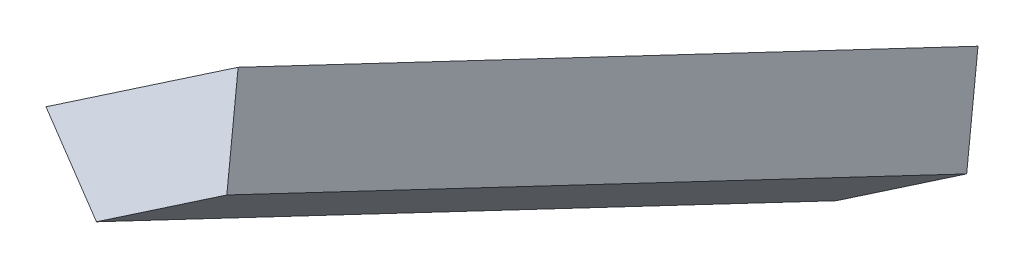
ISO-10303-21;
HEADER;
FILE_DESCRIPTION(('STEP AP214'),'2;1');
FILE_NAME('part.step','',(''),(''),'','','');
FILE_SCHEMA(('AUTOMOTIVE_DESIGN { 1 0 10303 214 1 1 1 1 }'));
ENDSEC;
DATA;
#1=APPLICATION_CONTEXT('core data for automotive mechanical design processes');
#2=APPLICATION_PROTOCOL_DEFINITION('international standard','automotive_design',2000,#1);
#3=PRODUCT_CONTEXT('',#1,'mechanical');
#4=PRODUCT('Part','Part','',(#3));
#5=PRODUCT_RELATED_PRODUCT_CATEGORY('part','',(#4));
#6=PRODUCT_DEFINITION_FORMATION('','',#4);
#7=PRODUCT_DEFINITION_CONTEXT('part definition',#1,'design');
#8=PRODUCT_DEFINITION('design','',#6,#7);
#9=PRODUCT_DEFINITION_SHAPE('','',#8);
#10=(LENGTH_UNIT() NAMED_UNIT(*) SI_UNIT(.MILLI.,.METRE.));
#11=(NAMED_UNIT(*) PLANE_ANGLE_UNIT() SI_UNIT($,.RADIAN.));
#12=(NAMED_UNIT(*) SI_UNIT($,.STERADIAN.) SOLID_ANGLE_UNIT());
#13=UNCERTAINTY_MEASURE_WITH_UNIT(LENGTH_MEASURE(1.E-05),#10,'distance_accuracy_value','');
#14=(GEOMETRIC_REPRESENTATION_CONTEXT(3) GLOBAL_UNCERTAINTY_ASSIGNED_CONTEXT((#13)) GLOBAL_UNIT_ASSIGNED_CONTEXT((#10,
#11,#12)) REPRESENTATION_CONTEXT('',''));
#15=CARTESIAN_POINT('',(0.,0.,0.));
#16=DIRECTION('',(0.,0.,1.));
#17=DIRECTION('',(1.,0.,0.));
#18=AXIS2_PLACEMENT_3D('',#15,#16,#17);
#19=CARTESIAN_POINT('',(-9.81853515268757,94.3301348946342,8.64655783941392));
#20=DIRECTION('',(-0.934792610632294,-0.18408948844942,0.303766086569405));
#21=DIRECTION('',(0.309047873167845,0.,0.951046482612933));
#22=AXIS2_PLACEMENT_3D('',#19,#20,#21);
#23=PLANE('',#22);
#24=DIRECTION('',(-0.307334088049531,0.847944500694674,-0.431897999606877));
#25=VECTOR('',#24,1.);
#26=CARTESIAN_POINT('',(-10.8869485574522,91.3475785039808,3.55118246824727));
#27=LINE('',#26,#25);
#28=CARTESIAN_POINT('',(-10.7349918670689,90.9283251736,3.76472790025564));
#29=VERTEX_POINT('',#28);
#30=CARTESIAN_POINT('',(-10.8869485574522,91.3475785039808,3.55118246824727));
#31=VERTEX_POINT('',#30);
#32=EDGE_CURVE('E97',#29,#31,#27,.T.);
#33=ORIENTED_EDGE('',*,*,#32,.T.);
#34=DIRECTION('',(-0.178068900794109,-0.497092731775569,-0.849229228527775));
#35=VECTOR('',#34,1.);
#36=CARTESIAN_POINT('',(-9.81853515268757,94.3301348946342,8.64655783941392));
#37=LINE('',#36,#35);
#38=CARTESIAN_POINT('',(-9.81853515268757,94.3301348946342,8.64655783941392));
#39=VERTEX_POINT('',#38);
#40=EDGE_CURVE('E11',#39,#31,#37,.T.);
#41=ORIENTED_EDGE('',*,*,#40,.F.);
#42=DIRECTION('',(-0.307334088049531,0.847944500694674,-0.431897999606877));
#43=VECTOR('',#42,1.);
#44=CARTESIAN_POINT('',(-9.81853515268757,94.3301348946342,8.64655783941392));
#45=LINE('',#44,#43);
#46=CARTESIAN_POINT('',(-9.66657846230426,93.9108815642534,8.86010327142229));
#47=VERTEX_POINT('',#46);
#48=EDGE_CURVE('E85',#47,#39,#45,.T.);
#49=ORIENTED_EDGE('',*,*,#48,.F.);
#50=DIRECTION('',(-0.178068900794109,-0.497092731775569,-0.849229228527775));
#51=VECTOR('',#50,1.);
#52=CARTESIAN_POINT('',(-9.66657846230426,93.9108815642534,8.86010327142229));
#53=LINE('',#52,#51);
#54=EDGE_CURVE('E93',#47,#29,#53,.T.);
#55=ORIENTED_EDGE('',*,*,#54,.T.);
#56=EDGE_LOOP('',(#33,#41,#49,#55));
#57=FACE_BOUND('',#56,.T.);
#58=ADVANCED_FACE('F34',(#57),#23,.F.);
#59=CARTESIAN_POINT('',(-10.5108331257332,93.9743739046871,8.99996411813385));
#60=DIRECTION('',(0.558938039832381,-0.761377752861772,0.32846945836028));
#61=DIRECTION('',(0.806104806775731,0.591772794654386,0.));
#62=AXIS2_PLACEMENT_3D('',#59,#60,#61);
#63=PLANE('',#62);
#64=DIRECTION('',(-0.809864022042166,-0.416176324967027,0.413421736654746));
#65=VECTOR('',#64,1.);
#66=CARTESIAN_POINT('',(-11.5792465304978,90.9918175140337,3.9045887469672));
#67=LINE('',#66,#65);
#68=CARTESIAN_POINT('',(-11.5792465304978,90.9918175140337,3.9045887469672));
#69=VERTEX_POINT('',#68);
#70=EDGE_CURVE('E89',#31,#69,#67,.T.);
#71=ORIENTED_EDGE('',*,*,#70,.T.);
#72=DIRECTION('',(-0.178068900794109,-0.497092731775569,-0.849229228527775));
#73=VECTOR('',#72,1.);
#74=CARTESIAN_POINT('',(-10.5108331257332,93.9743739046871,8.99996411813385));
#75=LINE('',#74,#73);
#76=CARTESIAN_POINT('',(-10.5108331257332,93.9743739046871,8.99996411813385));
#77=VERTEX_POINT('',#76);
#78=EDGE_CURVE('E42',#77,#69,#75,.T.);
#79=ORIENTED_EDGE('',*,*,#78,.F.);
#80=DIRECTION('',(-0.809864022042166,-0.416176324967027,0.413421736654746));
#81=VECTOR('',#80,1.);
#82=CARTESIAN_POINT('',(-10.5108331257332,93.9743739046871,8.99996411813385));
#83=LINE('',#82,#81);
#84=EDGE_CURVE('E80',#39,#77,#83,.T.);
#85=ORIENTED_EDGE('',*,*,#84,.F.);
#86=ORIENTED_EDGE('',*,*,#40,.T.);
#87=EDGE_LOOP('',(#71,#79,#85,#86));
#88=FACE_BOUND('',#87,.T.);
#89=ADVANCED_FACE('F88',(#88),#63,.F.);
#90=CARTESIAN_POINT('',(-10.1362995950887,93.6694992957726,9.09988787868204));
#91=DIRECTION('',(0.625717050942688,0.608870053848366,-0.487601712144526));
#92=DIRECTION('',(-0.697392776795336,0.716689134055826,0.));
#93=AXIS2_PLACEMENT_3D('',#90,#91,#92);
#94=PLANE('',#93);
#95=DIRECTION('',(0.759453513211678,-0.618203909355642,0.202618576956413));
#96=VECTOR('',#95,1.);
#97=CARTESIAN_POINT('',(-11.2047129998534,90.6869429051192,4.00451250751539));
#98=LINE('',#97,#96);
#99=CARTESIAN_POINT('',(-11.2047129998534,90.6869429051192,4.00451250751539));
#100=VERTEX_POINT('',#99);
#101=EDGE_CURVE('E67',#69,#100,#98,.T.);
#102=ORIENTED_EDGE('',*,*,#101,.T.);
#103=DIRECTION('',(-0.178068900794109,-0.497092731775569,-0.849229228527775));
#104=VECTOR('',#103,1.);
#105=CARTESIAN_POINT('',(-10.1362995950887,93.6694992957726,9.09988787868204));
#106=LINE('',#105,#104);
#107=CARTESIAN_POINT('',(-10.1362995950887,93.6694992957726,9.09988787868204));
#108=VERTEX_POINT('',#107);
#109=EDGE_CURVE('E90',#108,#100,#106,.T.);
#110=ORIENTED_EDGE('',*,*,#109,.F.);
#111=DIRECTION('',(0.759453513211678,-0.618203909355642,0.202618576956413));
#112=VECTOR('',#111,1.);
#113=CARTESIAN_POINT('',(-10.1362995950887,93.6694992957726,9.09988787868204));
#114=LINE('',#113,#112);
#115=EDGE_CURVE('E83',#77,#108,#114,.T.);
#116=ORIENTED_EDGE('',*,*,#115,.F.);
#117=ORIENTED_EDGE('',*,*,#78,.T.);
#118=EDGE_LOOP('',(#102,#110,#116,#117));
#119=FACE_BOUND('',#118,.T.);
#120=ADVANCED_FACE('F91',(#119),#94,.F.);
#121=CARTESIAN_POINT('',(-9.66657846230426,93.9108815642534,8.86010327142229));
#122=DIRECTION('',(-0.558938039832381,0.761377752861772,-0.32846945836028));
#123=DIRECTION('',(-0.806104806775731,-0.591772794654386,0.));
#124=AXIS2_PLACEMENT_3D('',#121,#122,#123);
#125=PLANE('',#124);
#126=DIRECTION('',(0.809864022042166,0.416176324967029,-0.413421736654743));
#127=VECTOR('',#126,1.);
#128=CARTESIAN_POINT('',(-10.7349918670689,90.9283251736,3.76472790025564));
#129=LINE('',#128,#127);
#130=EDGE_CURVE('E73',#100,#29,#129,.T.);
#131=ORIENTED_EDGE('',*,*,#130,.T.);
#132=ORIENTED_EDGE('',*,*,#54,.F.);
#133=DIRECTION('',(0.809864022042166,0.416176324967029,-0.413421736654743));
#134=VECTOR('',#133,1.);
#135=CARTESIAN_POINT('',(-9.66657846230426,93.9108815642534,8.86010327142229));
#136=LINE('',#135,#134);
#137=EDGE_CURVE('E50',#108,#47,#136,.T.);
#138=ORIENTED_EDGE('',*,*,#137,.F.);
#139=ORIENTED_EDGE('',*,*,#109,.T.);
#140=EDGE_LOOP('',(#131,#132,#138,#139));
#141=FACE_BOUND('',#140,.T.);
#142=ADVANCED_FACE('F104',(#141),#125,.F.);
#143=CARTESIAN_POINT('',(9.34601006469469,26.0900901479288,44.5721003592332));
#144=DIRECTION('',(-0.178068900794113,-0.497092731775562,-0.849229228527778));
#145=DIRECTION('',(0.,0.863022028054463,-0.505166288555324));
#146=AXIS2_PLACEMENT_3D('',#143,#144,#145);
#147=PLANE('',#146);
#148=ORIENTED_EDGE('',*,*,#48,.T.);
#149=ORIENTED_EDGE('',*,*,#84,.T.);
#150=ORIENTED_EDGE('',*,*,#115,.T.);
#151=ORIENTED_EDGE('',*,*,#137,.T.);
#152=EDGE_LOOP('',(#148,#149,#150,#151));
#153=FACE_BOUND('',#152,.T.);
#154=ADVANCED_FACE('F81',(#153),#147,.F.);
#155=CARTESIAN_POINT('',(8.27759665993004,23.1075337572754,39.4767249880665));
#156=DIRECTION('',(-0.178068900794113,-0.497092731775562,-0.849229228527778));
#157=DIRECTION('',(0.,0.863022028054463,-0.505166288555324));
#158=AXIS2_PLACEMENT_3D('',#155,#156,#157);
#159=PLANE('',#158);
#160=ORIENTED_EDGE('',*,*,#32,.F.);
#161=ORIENTED_EDGE('',*,*,#130,.F.);
#162=ORIENTED_EDGE('',*,*,#101,.F.);
#163=ORIENTED_EDGE('',*,*,#70,.F.);
#164=EDGE_LOOP('',(#160,#161,#162,#163));
#165=FACE_BOUND('',#164,.T.);
#166=ADVANCED_FACE('F107',(#165),#159,.T.);
#167=CLOSED_SHELL('',(#58,#89,#120,#142,#154,#166));
#168=MANIFOLD_SOLID_BREP('B2',#167);
#169=ADVANCED_BREP_SHAPE_REPRESENTATION('',(#18,#168),#14);
#170=SHAPE_DEFINITION_REPRESENTATION(#9,#169);
ENDSEC;
END-ISO-10303-21;
